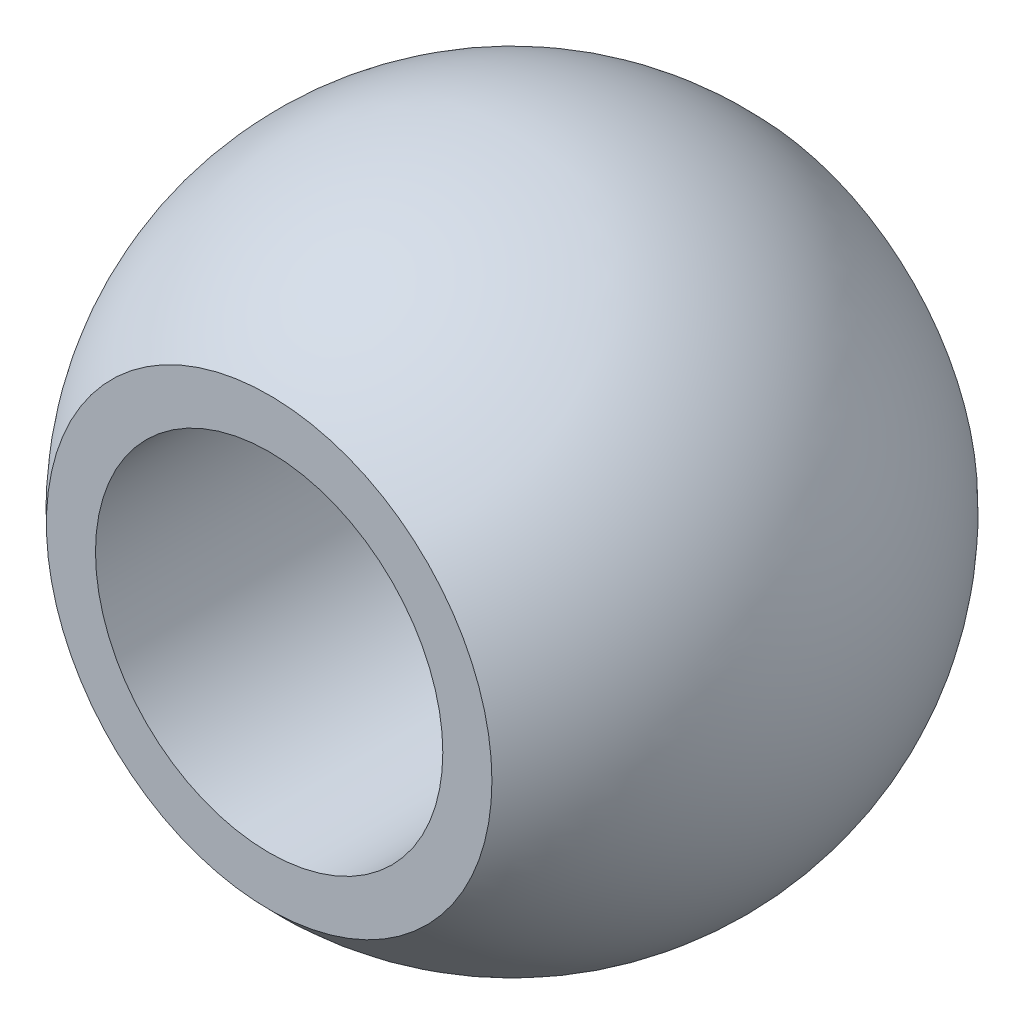
ISO-10303-21;
HEADER;
FILE_DESCRIPTION(('STEP AP214'),'2;1');
FILE_NAME('part.step','',(''),(''),'','','');
FILE_SCHEMA(('AUTOMOTIVE_DESIGN { 1 0 10303 214 1 1 1 1 }'));
ENDSEC;
DATA;
#1=APPLICATION_CONTEXT('core data for automotive mechanical design processes');
#2=APPLICATION_PROTOCOL_DEFINITION('international standard','automotive_design',2000,#1);
#3=PRODUCT_CONTEXT('',#1,'mechanical');
#4=PRODUCT('Part','Part','',(#3));
#5=PRODUCT_RELATED_PRODUCT_CATEGORY('part','',(#4));
#6=PRODUCT_DEFINITION_FORMATION('','',#4);
#7=PRODUCT_DEFINITION_CONTEXT('part definition',#1,'design');
#8=PRODUCT_DEFINITION('design','',#6,#7);
#9=PRODUCT_DEFINITION_SHAPE('','',#8);
#10=(LENGTH_UNIT() NAMED_UNIT(*) SI_UNIT(.MILLI.,.METRE.));
#11=(NAMED_UNIT(*) PLANE_ANGLE_UNIT() SI_UNIT($,.RADIAN.));
#12=(NAMED_UNIT(*) SI_UNIT($,.STERADIAN.) SOLID_ANGLE_UNIT());
#13=UNCERTAINTY_MEASURE_WITH_UNIT(LENGTH_MEASURE(1.E-05),#10,'distance_accuracy_value','');
#14=(GEOMETRIC_REPRESENTATION_CONTEXT(3) GLOBAL_UNCERTAINTY_ASSIGNED_CONTEXT((#13)) GLOBAL_UNIT_ASSIGNED_CONTEXT((#10,
#11,#12)) REPRESENTATION_CONTEXT('',''));
#15=CARTESIAN_POINT('',(0.,0.,0.));
#16=DIRECTION('',(0.,0.,1.));
#17=DIRECTION('',(1.,0.,0.));
#18=AXIS2_PLACEMENT_3D('',#15,#16,#17);
#19=CARTESIAN_POINT('',(0.,0.,0.));
#20=DIRECTION('',(0.,0.,0.999999999999998));
#21=DIRECTION('',(0.,1.,0.));
#22=AXIS2_PLACEMENT_3D('',#19,#20,#21);
#23=SPHERICAL_SURFACE('',#22,7.5311);
#24=CARTESIAN_POINT('',(3.5527136788005E-12,-3.60822483003176E-13,5.54989999999989));
#25=DIRECTION('',(0.,0.,0.999999999999998));
#26=DIRECTION('',(1.,0.,0.));
#27=AXIS2_PLACEMENT_3D('',#24,#25,#26);
#28=CIRCLE('',#27,5.09078355462104);
#29=CARTESIAN_POINT('',(5.09078355462459,-3.62094161654214E-13,5.54989999999988));
#30=VERTEX_POINT('',#29);
#31=EDGE_CURVE('E50',#30,#30,#28,.T.);
#32=ORIENTED_EDGE('',*,*,#31,.F.);
#33=EDGE_LOOP('',(#32));
#34=FACE_BOUND('',#33,.T.);
#35=CARTESIAN_POINT('',(-1.33226762955019E-12,-5.27355936696949E-13,-5.54989999999989));
#36=DIRECTION('',(0.,0.,0.999999999999998));
#37=DIRECTION('',(1.,0.,0.));
#38=AXIS2_PLACEMENT_3D('',#35,#36,#37);
#39=CIRCLE('',#38,5.09078355462104);
#40=CARTESIAN_POINT('',(5.09078355461971,-5.28627615347987E-13,-5.54989999999989));
#41=VERTEX_POINT('',#40);
#42=EDGE_CURVE('E10',#41,#41,#39,.T.);
#43=ORIENTED_EDGE('',*,*,#42,.T.);
#44=EDGE_LOOP('',(#43));
#45=FACE_BOUND('',#44,.T.);
#46=ADVANCED_FACE('F36',(#34,#45),#23,.T.);
#47=CARTESIAN_POINT('',(-8.88178419700125E-13,3.96874999999999,-5.54989999999977));
#48=DIRECTION('',(0.,0.,0.999999999999998));
#49=DIRECTION('',(1.,0.,0.));
#50=AXIS2_PLACEMENT_3D('',#47,#48,#49);
#51=PLANE('',#50);
#52=ORIENTED_EDGE('',*,*,#42,.F.);
#53=EDGE_LOOP('',(#52));
#54=FACE_BOUND('',#53,.T.);
#55=CARTESIAN_POINT('',(-1.33226762955019E-12,-5.27355936696949E-13,-5.54989999999989));
#56=DIRECTION('',(0.,0.,0.999999999999998));
#57=DIRECTION('',(1.,0.,0.));
#58=AXIS2_PLACEMENT_3D('',#55,#56,#57);
#59=CIRCLE('',#58,3.96875);
#60=CARTESIAN_POINT('',(3.96874999999867,-5.2834733116347E-13,-5.54989999999989));
#61=VERTEX_POINT('',#60);
#62=EDGE_CURVE('E42',#61,#61,#59,.T.);
#63=ORIENTED_EDGE('',*,*,#62,.T.);
#64=EDGE_LOOP('',(#63));
#65=FACE_BOUND('',#64,.T.);
#66=ADVANCED_FACE('F59',(#54,#65),#51,.F.);
#67=CARTESIAN_POINT('',(0.,3.05311331771918E-13,31.2589553314226));
#68=DIRECTION('',(0.,0.,0.999999999999998));
#69=DIRECTION('',(1.,0.,0.));
#70=AXIS2_PLACEMENT_3D('',#67,#68,#69);
#71=CYLINDRICAL_SURFACE('',#70,3.96875);
#72=ORIENTED_EDGE('',*,*,#62,.F.);
#73=EDGE_LOOP('',(#72));
#74=FACE_BOUND('',#73,.T.);
#75=CARTESIAN_POINT('',(3.5527136788005E-12,-3.60822483003176E-13,5.54989999999989));
#76=DIRECTION('',(0.,0.,0.999999999999998));
#77=DIRECTION('',(1.,0.,0.));
#78=AXIS2_PLACEMENT_3D('',#75,#76,#77);
#79=CIRCLE('',#78,3.96875);
#80=CARTESIAN_POINT('',(3.96875000000356,-3.61813877469697E-13,5.54989999999988));
#81=VERTEX_POINT('',#80);
#82=EDGE_CURVE('E46',#81,#81,#79,.T.);
#83=ORIENTED_EDGE('',*,*,#82,.T.);
#84=EDGE_LOOP('',(#83));
#85=FACE_BOUND('',#84,.T.);
#86=ADVANCED_FACE('F62',(#74,#85),#71,.F.);
#87=CARTESIAN_POINT('',(-2.22044604925031E-12,5.0907835546207,5.54990000000022));
#88=DIRECTION('',(0.,0.,-0.999999999999998));
#89=DIRECTION('',(-1.,0.,0.));
#90=AXIS2_PLACEMENT_3D('',#87,#88,#89);
#91=PLANE('',#90);
#92=ORIENTED_EDGE('',*,*,#82,.F.);
#93=EDGE_LOOP('',(#92));
#94=FACE_BOUND('',#93,.T.);
#95=ORIENTED_EDGE('',*,*,#31,.T.);
#96=EDGE_LOOP('',(#95));
#97=FACE_BOUND('',#96,.T.);
#98=ADVANCED_FACE('F56',(#94,#97),#91,.F.);
#99=CLOSED_SHELL('',(#46,#66,#86,#98));
#100=MANIFOLD_SOLID_BREP('B2',#99);
#101=ADVANCED_BREP_SHAPE_REPRESENTATION('',(#18,#100),#14);
#102=SHAPE_DEFINITION_REPRESENTATION(#9,#101);
ENDSEC;
END-ISO-10303-21;
